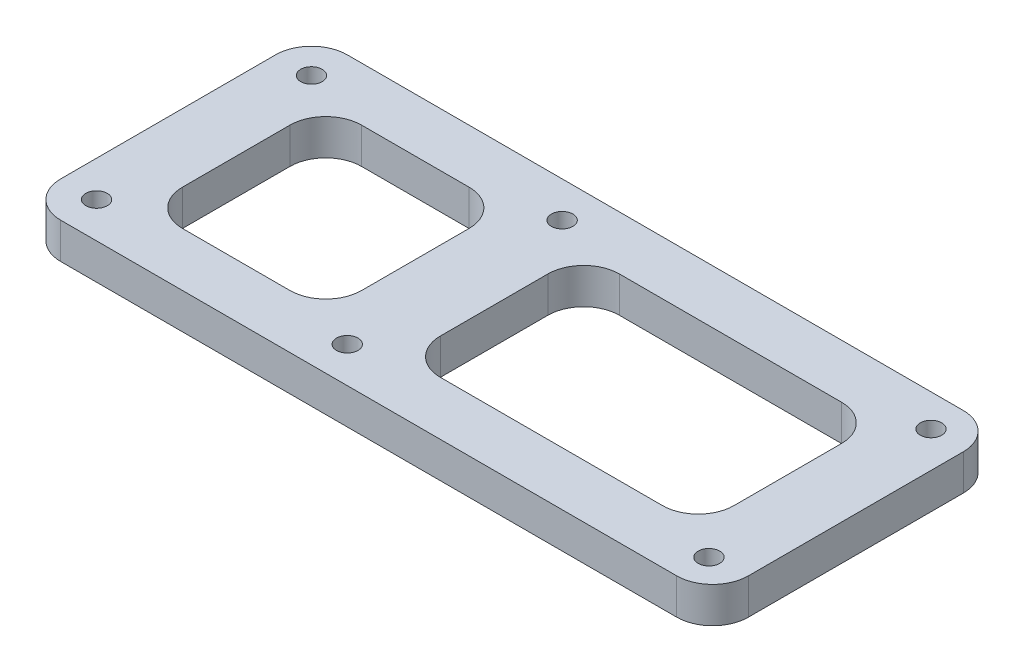
ISO-10303-21;
HEADER;
FILE_DESCRIPTION(('STEP AP214'),'2;1');
FILE_NAME('part.step','',(''),(''),'','','');
FILE_SCHEMA(('AUTOMOTIVE_DESIGN { 1 0 10303 214 1 1 1 1 }'));
ENDSEC;
DATA;
#1=APPLICATION_CONTEXT('core data for automotive mechanical design processes');
#2=APPLICATION_PROTOCOL_DEFINITION('international standard','automotive_design',2000,#1);
#3=PRODUCT_CONTEXT('',#1,'mechanical');
#4=PRODUCT('Part','Part','',(#3));
#5=PRODUCT_RELATED_PRODUCT_CATEGORY('part','',(#4));
#6=PRODUCT_DEFINITION_FORMATION('','',#4);
#7=PRODUCT_DEFINITION_CONTEXT('part definition',#1,'design');
#8=PRODUCT_DEFINITION('design','',#6,#7);
#9=PRODUCT_DEFINITION_SHAPE('','',#8);
#10=(LENGTH_UNIT() NAMED_UNIT(*) SI_UNIT(.MILLI.,.METRE.));
#11=(NAMED_UNIT(*) PLANE_ANGLE_UNIT() SI_UNIT($,.RADIAN.));
#12=(NAMED_UNIT(*) SI_UNIT($,.STERADIAN.) SOLID_ANGLE_UNIT());
#13=UNCERTAINTY_MEASURE_WITH_UNIT(LENGTH_MEASURE(1.E-05),#10,'distance_accuracy_value','');
#14=(GEOMETRIC_REPRESENTATION_CONTEXT(3) GLOBAL_UNCERTAINTY_ASSIGNED_CONTEXT((#13)) GLOBAL_UNIT_ASSIGNED_CONTEXT((#10,
#11,#12)) REPRESENTATION_CONTEXT('',''));
#15=CARTESIAN_POINT('',(0.,0.,0.));
#16=DIRECTION('',(0.,0.,1.));
#17=DIRECTION('',(1.,0.,0.));
#18=AXIS2_PLACEMENT_3D('',#15,#16,#17);
#19=CARTESIAN_POINT('',(0.,5.,12.5));
#20=DIRECTION('',(0.,0.,-1.));
#21=DIRECTION('',(-1.,0.,0.));
#22=AXIS2_PLACEMENT_3D('',#19,#20,#21);
#23=PLANE('',#22);
#24=DIRECTION('',(1.,0.,0.));
#25=VECTOR('',#24,1.);
#26=CARTESIAN_POINT('',(0.,5.,12.5));
#27=LINE('',#26,#25);
#28=CARTESIAN_POINT('',(-25.5,5.,12.5));
#29=VERTEX_POINT('',#28);
#30=CARTESIAN_POINT('',(-10.5,5.,12.5));
#31=VERTEX_POINT('',#30);
#32=EDGE_CURVE('E368',#29,#31,#27,.T.);
#33=ORIENTED_EDGE('',*,*,#32,.T.);
#34=DIRECTION('',(0.,-1.,0.));
#35=VECTOR('',#34,1.);
#36=CARTESIAN_POINT('',(-10.5,5.,12.5));
#37=LINE('',#36,#35);
#38=CARTESIAN_POINT('',(-10.5,0.,12.5));
#39=VERTEX_POINT('',#38);
#40=EDGE_CURVE('E248',#31,#39,#37,.T.);
#41=ORIENTED_EDGE('',*,*,#40,.T.);
#42=DIRECTION('',(1.,0.,0.));
#43=VECTOR('',#42,1.);
#44=CARTESIAN_POINT('',(0.,0.,12.5));
#45=LINE('',#44,#43);
#46=CARTESIAN_POINT('',(-25.5,0.,12.5));
#47=VERTEX_POINT('',#46);
#48=EDGE_CURVE('E409',#47,#39,#45,.T.);
#49=ORIENTED_EDGE('',*,*,#48,.F.);
#50=DIRECTION('',(0.,-1.,0.));
#51=VECTOR('',#50,1.);
#52=CARTESIAN_POINT('',(-25.5,5.,12.5));
#53=LINE('',#52,#51);
#54=EDGE_CURVE('E246',#47,#29,#53,.F.);
#55=ORIENTED_EDGE('',*,*,#54,.T.);
#56=EDGE_LOOP('',(#33,#41,#49,#55));
#57=FACE_BOUND('',#56,.T.);
#58=ADVANCED_FACE('F35',(#57),#23,.T.);
#59=CARTESIAN_POINT('',(-30.5,5.,0.));
#60=DIRECTION('',(1.,0.,0.));
#61=DIRECTION('',(0.,0.,-1.));
#62=AXIS2_PLACEMENT_3D('',#59,#60,#61);
#63=PLANE('',#62);
#64=DIRECTION('',(0.,0.,1.));
#65=VECTOR('',#64,1.);
#66=CARTESIAN_POINT('',(-30.5,5.,0.));
#67=LINE('',#66,#65);
#68=CARTESIAN_POINT('',(-30.5,5.,-7.5));
#69=VERTEX_POINT('',#68);
#70=CARTESIAN_POINT('',(-30.5,5.,7.5));
#71=VERTEX_POINT('',#70);
#72=EDGE_CURVE('E371',#69,#71,#67,.T.);
#73=ORIENTED_EDGE('',*,*,#72,.T.);
#74=DIRECTION('',(0.,-1.,0.));
#75=VECTOR('',#74,1.);
#76=CARTESIAN_POINT('',(-30.5,0.,7.5));
#77=LINE('',#76,#75);
#78=CARTESIAN_POINT('',(-30.5,0.,7.5));
#79=VERTEX_POINT('',#78);
#80=EDGE_CURVE('E258',#71,#79,#77,.T.);
#81=ORIENTED_EDGE('',*,*,#80,.T.);
#82=DIRECTION('',(0.,0.,1.));
#83=VECTOR('',#82,1.);
#84=CARTESIAN_POINT('',(-30.5,0.,0.));
#85=LINE('',#84,#83);
#86=CARTESIAN_POINT('',(-30.5,0.,-7.5));
#87=VERTEX_POINT('',#86);
#88=EDGE_CURVE('E412',#87,#79,#85,.T.);
#89=ORIENTED_EDGE('',*,*,#88,.F.);
#90=DIRECTION('',(0.,-1.,0.));
#91=VECTOR('',#90,1.);
#92=CARTESIAN_POINT('',(-30.5,5.,-7.5));
#93=LINE('',#92,#91);
#94=EDGE_CURVE('E256',#87,#69,#93,.F.);
#95=ORIENTED_EDGE('',*,*,#94,.T.);
#96=EDGE_LOOP('',(#73,#81,#89,#95));
#97=FACE_BOUND('',#96,.T.);
#98=ADVANCED_FACE('F459',(#97),#63,.T.);
#99=CARTESIAN_POINT('',(0.,5.,-12.5));
#100=DIRECTION('',(0.,0.,-1.));
#101=DIRECTION('',(-1.,0.,0.));
#102=AXIS2_PLACEMENT_3D('',#99,#100,#101);
#103=PLANE('',#102);
#104=DIRECTION('',(1.,0.,0.));
#105=VECTOR('',#104,1.);
#106=CARTESIAN_POINT('',(0.,0.,-12.5));
#107=LINE('',#106,#105);
#108=CARTESIAN_POINT('',(-25.5,0.,-12.5));
#109=VERTEX_POINT('',#108);
#110=CARTESIAN_POINT('',(-10.5,0.,-12.5));
#111=VERTEX_POINT('',#110);
#112=EDGE_CURVE('E415',#109,#111,#107,.T.);
#113=ORIENTED_EDGE('',*,*,#112,.T.);
#114=DIRECTION('',(0.,-1.,0.));
#115=VECTOR('',#114,1.);
#116=CARTESIAN_POINT('',(-10.5,5.,-12.5));
#117=LINE('',#116,#115);
#118=CARTESIAN_POINT('',(-10.5,5.,-12.5));
#119=VERTEX_POINT('',#118);
#120=EDGE_CURVE('E264',#111,#119,#117,.F.);
#121=ORIENTED_EDGE('',*,*,#120,.T.);
#122=DIRECTION('',(1.,0.,0.));
#123=VECTOR('',#122,1.);
#124=CARTESIAN_POINT('',(0.,5.,-12.5));
#125=LINE('',#124,#123);
#126=CARTESIAN_POINT('',(-25.5,5.,-12.5));
#127=VERTEX_POINT('',#126);
#128=EDGE_CURVE('E374',#127,#119,#125,.T.);
#129=ORIENTED_EDGE('',*,*,#128,.F.);
#130=DIRECTION('',(0.,-1.,0.));
#131=VECTOR('',#130,1.);
#132=CARTESIAN_POINT('',(-25.5,5.,-12.5));
#133=LINE('',#132,#131);
#134=EDGE_CURVE('E261',#127,#109,#133,.T.);
#135=ORIENTED_EDGE('',*,*,#134,.T.);
#136=EDGE_LOOP('',(#113,#121,#129,#135));
#137=FACE_BOUND('',#136,.T.);
#138=ADVANCED_FACE('F465',(#137),#103,.F.);
#139=CARTESIAN_POINT('',(0.,5.,20.));
#140=DIRECTION('',(0.,0.,-1.));
#141=DIRECTION('',(-1.,0.,0.));
#142=AXIS2_PLACEMENT_3D('',#139,#140,#141);
#143=PLANE('',#142);
#144=DIRECTION('',(1.,0.,0.));
#145=VECTOR('',#144,1.);
#146=CARTESIAN_POINT('',(0.,0.,20.));
#147=LINE('',#146,#145);
#148=CARTESIAN_POINT('',(-35.,0.,20.));
#149=VERTEX_POINT('',#148);
#150=CARTESIAN_POINT('',(51.,0.,20.));
#151=VERTEX_POINT('',#150);
#152=EDGE_CURVE('E395',#149,#151,#147,.T.);
#153=ORIENTED_EDGE('',*,*,#152,.T.);
#154=DIRECTION('',(0.,-1.,0.));
#155=VECTOR('',#154,1.);
#156=CARTESIAN_POINT('',(51.,5.,20.));
#157=LINE('',#156,#155);
#158=CARTESIAN_POINT('',(51.,5.,20.));
#159=VERTEX_POINT('',#158);
#160=EDGE_CURVE('E294',#151,#159,#157,.F.);
#161=ORIENTED_EDGE('',*,*,#160,.T.);
#162=DIRECTION('',(1.,0.,0.));
#163=VECTOR('',#162,1.);
#164=CARTESIAN_POINT('',(0.,5.,20.));
#165=LINE('',#164,#163);
#166=CARTESIAN_POINT('',(-35.,5.,20.));
#167=VERTEX_POINT('',#166);
#168=EDGE_CURVE('E349',#167,#159,#165,.T.);
#169=ORIENTED_EDGE('',*,*,#168,.F.);
#170=DIRECTION('',(0.,-1.,0.));
#171=VECTOR('',#170,1.);
#172=CARTESIAN_POINT('',(-35.,5.,20.));
#173=LINE('',#172,#171);
#174=EDGE_CURVE('E291',#167,#149,#173,.T.);
#175=ORIENTED_EDGE('',*,*,#174,.T.);
#176=EDGE_LOOP('',(#153,#161,#169,#175));
#177=FACE_BOUND('',#176,.T.);
#178=ADVANCED_FACE('F485',(#177),#143,.F.);
#179=CARTESIAN_POINT('',(56.,5.,0.));
#180=DIRECTION('',(1.,0.,0.));
#181=DIRECTION('',(0.,0.,-1.));
#182=AXIS2_PLACEMENT_3D('',#179,#180,#181);
#183=PLANE('',#182);
#184=DIRECTION('',(0.,0.,1.));
#185=VECTOR('',#184,1.);
#186=CARTESIAN_POINT('',(56.,0.,0.));
#187=LINE('',#186,#185);
#188=CARTESIAN_POINT('',(56.,0.,-15.));
#189=VERTEX_POINT('',#188);
#190=CARTESIAN_POINT('',(56.,0.,15.));
#191=VERTEX_POINT('',#190);
#192=EDGE_CURVE('E398',#189,#191,#187,.T.);
#193=ORIENTED_EDGE('',*,*,#192,.F.);
#194=DIRECTION('',(0.,-1.,0.));
#195=VECTOR('',#194,1.);
#196=CARTESIAN_POINT('',(56.,5.,-15.));
#197=LINE('',#196,#195);
#198=CARTESIAN_POINT('',(56.,5.,-15.));
#199=VERTEX_POINT('',#198);
#200=EDGE_CURVE('E282',#189,#199,#197,.F.);
#201=ORIENTED_EDGE('',*,*,#200,.T.);
#202=DIRECTION('',(0.,0.,1.));
#203=VECTOR('',#202,1.);
#204=CARTESIAN_POINT('',(56.,5.,0.));
#205=LINE('',#204,#203);
#206=CARTESIAN_POINT('',(56.,5.,15.));
#207=VERTEX_POINT('',#206);
#208=EDGE_CURVE('E357',#199,#207,#205,.T.);
#209=ORIENTED_EDGE('',*,*,#208,.T.);
#210=DIRECTION('',(0.,-1.,0.));
#211=VECTOR('',#210,1.);
#212=CARTESIAN_POINT('',(56.,0.,15.));
#213=LINE('',#212,#211);
#214=EDGE_CURVE('E279',#207,#191,#213,.T.);
#215=ORIENTED_EDGE('',*,*,#214,.T.);
#216=EDGE_LOOP('',(#193,#201,#209,#215));
#217=FACE_BOUND('',#216,.T.);
#218=ADVANCED_FACE('F481',(#217),#183,.T.);
#219=CARTESIAN_POINT('',(0.,5.,-20.));
#220=DIRECTION('',(0.,0.,-1.));
#221=DIRECTION('',(-1.,0.,0.));
#222=AXIS2_PLACEMENT_3D('',#219,#220,#221);
#223=PLANE('',#222);
#224=DIRECTION('',(1.,0.,0.));
#225=VECTOR('',#224,1.);
#226=CARTESIAN_POINT('',(0.,5.,-20.));
#227=LINE('',#226,#225);
#228=CARTESIAN_POINT('',(-35.,5.,-20.));
#229=VERTEX_POINT('',#228);
#230=CARTESIAN_POINT('',(51.,5.,-20.));
#231=VERTEX_POINT('',#230);
#232=EDGE_CURVE('E360',#229,#231,#227,.T.);
#233=ORIENTED_EDGE('',*,*,#232,.T.);
#234=DIRECTION('',(0.,-1.,0.));
#235=VECTOR('',#234,1.);
#236=CARTESIAN_POINT('',(51.,5.,-20.));
#237=LINE('',#236,#235);
#238=CARTESIAN_POINT('',(51.,0.,-20.));
#239=VERTEX_POINT('',#238);
#240=EDGE_CURVE('E268',#231,#239,#237,.T.);
#241=ORIENTED_EDGE('',*,*,#240,.T.);
#242=DIRECTION('',(1.,0.,0.));
#243=VECTOR('',#242,1.);
#244=CARTESIAN_POINT('',(0.,0.,-20.));
#245=LINE('',#244,#243);
#246=CARTESIAN_POINT('',(-35.,0.,-20.));
#247=VERTEX_POINT('',#246);
#248=EDGE_CURVE('E401',#247,#239,#245,.T.);
#249=ORIENTED_EDGE('',*,*,#248,.F.);
#250=DIRECTION('',(0.,-1.,0.));
#251=VECTOR('',#250,1.);
#252=CARTESIAN_POINT('',(-35.,5.,-20.));
#253=LINE('',#252,#251);
#254=EDGE_CURVE('E266',#247,#229,#253,.F.);
#255=ORIENTED_EDGE('',*,*,#254,.T.);
#256=EDGE_LOOP('',(#233,#241,#249,#255));
#257=FACE_BOUND('',#256,.T.);
#258=ADVANCED_FACE('F478',(#257),#223,.T.);
#259=CARTESIAN_POINT('',(0.,5.,12.5));
#260=DIRECTION('',(0.,0.,-1.));
#261=DIRECTION('',(-1.,0.,0.));
#262=AXIS2_PLACEMENT_3D('',#259,#260,#261);
#263=PLANE('',#262);
#264=DIRECTION('',(1.,0.,0.));
#265=VECTOR('',#264,1.);
#266=CARTESIAN_POINT('',(0.,5.,12.5));
#267=LINE('',#266,#265);
#268=CARTESIAN_POINT('',(10.5,5.,12.5));
#269=VERTEX_POINT('',#268);
#270=CARTESIAN_POINT('',(41.5,5.,12.5));
#271=VERTEX_POINT('',#270);
#272=EDGE_CURVE('E351',#269,#271,#267,.T.);
#273=ORIENTED_EDGE('',*,*,#272,.T.);
#274=DIRECTION('',(0.,-1.,0.));
#275=VECTOR('',#274,1.);
#276=CARTESIAN_POINT('',(41.5,5.,12.5));
#277=LINE('',#276,#275);
#278=CARTESIAN_POINT('',(41.5,0.,12.5));
#279=VERTEX_POINT('',#278);
#280=EDGE_CURVE('E218',#271,#279,#277,.T.);
#281=ORIENTED_EDGE('',*,*,#280,.T.);
#282=DIRECTION('',(1.,0.,0.));
#283=VECTOR('',#282,1.);
#284=CARTESIAN_POINT('',(0.,0.,12.5));
#285=LINE('',#284,#283);
#286=CARTESIAN_POINT('',(10.5,0.,12.5));
#287=VERTEX_POINT('',#286);
#288=EDGE_CURVE('E201',#287,#279,#285,.T.);
#289=ORIENTED_EDGE('',*,*,#288,.F.);
#290=DIRECTION('',(0.,-1.,0.));
#291=VECTOR('',#290,1.);
#292=CARTESIAN_POINT('',(10.5,5.,12.5));
#293=LINE('',#292,#291);
#294=EDGE_CURVE('E215',#287,#269,#293,.F.);
#295=ORIENTED_EDGE('',*,*,#294,.T.);
#296=EDGE_LOOP('',(#273,#281,#289,#295));
#297=FACE_BOUND('',#296,.T.);
#298=ADVANCED_FACE('F214',(#297),#263,.T.);
#299=CARTESIAN_POINT('',(5.5,5.,0.));
#300=DIRECTION('',(1.,0.,0.));
#301=DIRECTION('',(0.,0.,-1.));
#302=AXIS2_PLACEMENT_3D('',#299,#300,#301);
#303=PLANE('',#302);
#304=DIRECTION('',(0.,0.,1.));
#305=VECTOR('',#304,1.);
#306=CARTESIAN_POINT('',(5.5,5.,0.));
#307=LINE('',#306,#305);
#308=CARTESIAN_POINT('',(5.5,5.,-7.5));
#309=VERTEX_POINT('',#308);
#310=CARTESIAN_POINT('',(5.5,5.,7.5));
#311=VERTEX_POINT('',#310);
#312=EDGE_CURVE('E342',#309,#311,#307,.T.);
#313=ORIENTED_EDGE('',*,*,#312,.T.);
#314=DIRECTION('',(0.,-1.,0.));
#315=VECTOR('',#314,1.);
#316=CARTESIAN_POINT('',(5.5,0.,7.5));
#317=LINE('',#316,#315);
#318=CARTESIAN_POINT('',(5.5,0.,7.5));
#319=VERTEX_POINT('',#318);
#320=EDGE_CURVE('E239',#311,#319,#317,.T.);
#321=ORIENTED_EDGE('',*,*,#320,.T.);
#322=DIRECTION('',(0.,0.,1.));
#323=VECTOR('',#322,1.);
#324=CARTESIAN_POINT('',(5.5,0.,0.));
#325=LINE('',#324,#323);
#326=CARTESIAN_POINT('',(5.5,0.,-7.5));
#327=VERTEX_POINT('',#326);
#328=EDGE_CURVE('E203',#327,#319,#325,.T.);
#329=ORIENTED_EDGE('',*,*,#328,.F.);
#330=DIRECTION('',(0.,-1.,0.));
#331=VECTOR('',#330,1.);
#332=CARTESIAN_POINT('',(5.5,5.,-7.5));
#333=LINE('',#332,#331);
#334=EDGE_CURVE('E237',#327,#309,#333,.F.);
#335=ORIENTED_EDGE('',*,*,#334,.T.);
#336=EDGE_LOOP('',(#313,#321,#329,#335));
#337=FACE_BOUND('',#336,.T.);
#338=ADVANCED_FACE('F331',(#337),#303,.T.);
#339=CARTESIAN_POINT('',(0.,5.,-12.5));
#340=DIRECTION('',(0.,0.,-1.));
#341=DIRECTION('',(-1.,0.,0.));
#342=AXIS2_PLACEMENT_3D('',#339,#340,#341);
#343=PLANE('',#342);
#344=DIRECTION('',(1.,0.,0.));
#345=VECTOR('',#344,1.);
#346=CARTESIAN_POINT('',(0.,0.,-12.5));
#347=LINE('',#346,#345);
#348=CARTESIAN_POINT('',(10.5,0.,-12.5));
#349=VERTEX_POINT('',#348);
#350=CARTESIAN_POINT('',(41.5,0.,-12.5));
#351=VERTEX_POINT('',#350);
#352=EDGE_CURVE('E325',#349,#351,#347,.T.);
#353=ORIENTED_EDGE('',*,*,#352,.T.);
#354=DIRECTION('',(0.,-1.,0.));
#355=VECTOR('',#354,1.);
#356=CARTESIAN_POINT('',(41.5,5.,-12.5));
#357=LINE('',#356,#355);
#358=CARTESIAN_POINT('',(41.5,5.,-12.5));
#359=VERTEX_POINT('',#358);
#360=EDGE_CURVE('E244',#351,#359,#357,.F.);
#361=ORIENTED_EDGE('',*,*,#360,.T.);
#362=DIRECTION('',(1.,0.,0.));
#363=VECTOR('',#362,1.);
#364=CARTESIAN_POINT('',(0.,5.,-12.5));
#365=LINE('',#364,#363);
#366=CARTESIAN_POINT('',(10.5,5.,-12.5));
#367=VERTEX_POINT('',#366);
#368=EDGE_CURVE('E340',#367,#359,#365,.T.);
#369=ORIENTED_EDGE('',*,*,#368,.F.);
#370=DIRECTION('',(0.,-1.,0.));
#371=VECTOR('',#370,1.);
#372=CARTESIAN_POINT('',(10.5,5.,-12.5));
#373=LINE('',#372,#371);
#374=EDGE_CURVE('E241',#367,#349,#373,.T.);
#375=ORIENTED_EDGE('',*,*,#374,.T.);
#376=EDGE_LOOP('',(#353,#361,#369,#375));
#377=FACE_BOUND('',#376,.T.);
#378=ADVANCED_FACE('F344',(#377),#343,.F.);
#379=CARTESIAN_POINT('',(-35.,5.,15.));
#380=DIRECTION('',(0.,-1.,0.));
#381=DIRECTION('',(0.,0.,-1.));
#382=AXIS2_PLACEMENT_3D('',#379,#380,#381);
#383=CYLINDRICAL_SURFACE('',#382,1.5);
#384=CARTESIAN_POINT('',(-35.,5.,15.));
#385=DIRECTION('',(0.,1.,0.));
#386=DIRECTION('',(0.,0.,1.));
#387=AXIS2_PLACEMENT_3D('',#384,#385,#386);
#388=CIRCLE('',#387,1.5);
#389=CARTESIAN_POINT('',(-35.,5.,16.5));
#390=VERTEX_POINT('',#389);
#391=EDGE_CURVE('E227',#390,#390,#388,.T.);
#392=ORIENTED_EDGE('',*,*,#391,.T.);
#393=EDGE_LOOP('',(#392));
#394=FACE_BOUND('',#393,.T.);
#395=CARTESIAN_POINT('',(-35.,0.,15.));
#396=DIRECTION('',(0.,1.,0.));
#397=DIRECTION('',(0.,0.,1.));
#398=AXIS2_PLACEMENT_3D('',#395,#396,#397);
#399=CIRCLE('',#398,1.5);
#400=CARTESIAN_POINT('',(-35.,0.,16.5));
#401=VERTEX_POINT('',#400);
#402=EDGE_CURVE('E429',#401,#401,#399,.T.);
#403=ORIENTED_EDGE('',*,*,#402,.F.);
#404=EDGE_LOOP('',(#403));
#405=FACE_BOUND('',#404,.T.);
#406=ADVANCED_FACE('F495',(#394,#405),#383,.F.);
#407=CARTESIAN_POINT('',(0.,5.,15.));
#408=DIRECTION('',(0.,-1.,0.));
#409=DIRECTION('',(0.,0.,-1.));
#410=AXIS2_PLACEMENT_3D('',#407,#408,#409);
#411=CYLINDRICAL_SURFACE('',#410,1.5);
#412=CARTESIAN_POINT('',(0.,5.,15.));
#413=DIRECTION('',(0.,1.,0.));
#414=DIRECTION('',(0.,0.,1.));
#415=AXIS2_PLACEMENT_3D('',#412,#413,#414);
#416=CIRCLE('',#415,1.5);
#417=CARTESIAN_POINT('',(0.,5.,16.5));
#418=VERTEX_POINT('',#417);
#419=EDGE_CURVE('E386',#418,#418,#416,.T.);
#420=ORIENTED_EDGE('',*,*,#419,.T.);
#421=EDGE_LOOP('',(#420));
#422=FACE_BOUND('',#421,.T.);
#423=CARTESIAN_POINT('',(0.,0.,15.));
#424=DIRECTION('',(0.,1.,0.));
#425=DIRECTION('',(0.,0.,1.));
#426=AXIS2_PLACEMENT_3D('',#423,#424,#425);
#427=CIRCLE('',#426,1.5);
#428=CARTESIAN_POINT('',(0.,0.,16.5));
#429=VERTEX_POINT('',#428);
#430=EDGE_CURVE('E427',#429,#429,#427,.T.);
#431=ORIENTED_EDGE('',*,*,#430,.F.);
#432=EDGE_LOOP('',(#431));
#433=FACE_BOUND('',#432,.T.);
#434=ADVANCED_FACE('F515',(#422,#433),#411,.F.);
#435=CARTESIAN_POINT('',(50.9975489607099,5.,-15.5));
#436=DIRECTION('',(0.,-1.,0.));
#437=DIRECTION('',(0.,0.,-1.));
#438=AXIS2_PLACEMENT_3D('',#435,#436,#437);
#439=CYLINDRICAL_SURFACE('',#438,1.5);
#440=CARTESIAN_POINT('',(50.9975489607099,5.,-15.5));
#441=DIRECTION('',(0.,1.,0.));
#442=DIRECTION('',(0.,0.,1.));
#443=AXIS2_PLACEMENT_3D('',#440,#441,#442);
#444=CIRCLE('',#443,1.5);
#445=CARTESIAN_POINT('',(50.9975489607099,5.,-14.));
#446=VERTEX_POINT('',#445);
#447=EDGE_CURVE('E383',#446,#446,#444,.F.);
#448=ORIENTED_EDGE('',*,*,#447,.F.);
#449=EDGE_LOOP('',(#448));
#450=FACE_BOUND('',#449,.T.);
#451=CARTESIAN_POINT('',(50.9975489607099,0.,-15.5));
#452=DIRECTION('',(0.,1.,0.));
#453=DIRECTION('',(0.,0.,1.));
#454=AXIS2_PLACEMENT_3D('',#451,#452,#453);
#455=CIRCLE('',#454,1.5);
#456=CARTESIAN_POINT('',(50.9975489607099,0.,-14.));
#457=VERTEX_POINT('',#456);
#458=EDGE_CURVE('E424',#457,#457,#455,.F.);
#459=ORIENTED_EDGE('',*,*,#458,.T.);
#460=EDGE_LOOP('',(#459));
#461=FACE_BOUND('',#460,.T.);
#462=ADVANCED_FACE('F519',(#450,#461),#439,.F.);
#463=CARTESIAN_POINT('',(-35.,5.,-15.));
#464=DIRECTION('',(0.,-1.,0.));
#465=DIRECTION('',(0.,0.,-1.));
#466=AXIS2_PLACEMENT_3D('',#463,#464,#465);
#467=CYLINDRICAL_SURFACE('',#466,1.5);
#468=CARTESIAN_POINT('',(-35.,5.,-15.));
#469=DIRECTION('',(0.,1.,0.));
#470=DIRECTION('',(0.,0.,1.));
#471=AXIS2_PLACEMENT_3D('',#468,#469,#470);
#472=CIRCLE('',#471,1.5);
#473=CARTESIAN_POINT('',(-35.,5.,-13.5));
#474=VERTEX_POINT('',#473);
#475=EDGE_CURVE('E380',#474,#474,#472,.T.);
#476=ORIENTED_EDGE('',*,*,#475,.T.);
#477=EDGE_LOOP('',(#476));
#478=FACE_BOUND('',#477,.T.);
#479=CARTESIAN_POINT('',(-35.,0.,-15.));
#480=DIRECTION('',(0.,1.,0.));
#481=DIRECTION('',(0.,0.,1.));
#482=AXIS2_PLACEMENT_3D('',#479,#480,#481);
#483=CIRCLE('',#482,1.5);
#484=CARTESIAN_POINT('',(-35.,0.,-13.5));
#485=VERTEX_POINT('',#484);
#486=EDGE_CURVE('E421',#485,#485,#483,.T.);
#487=ORIENTED_EDGE('',*,*,#486,.F.);
#488=EDGE_LOOP('',(#487));
#489=FACE_BOUND('',#488,.T.);
#490=ADVANCED_FACE('F523',(#478,#489),#467,.F.);
#491=CARTESIAN_POINT('',(-5.5,5.,0.));
#492=DIRECTION('',(1.,0.,0.));
#493=DIRECTION('',(0.,0.,-1.));
#494=AXIS2_PLACEMENT_3D('',#491,#492,#493);
#495=PLANE('',#494);
#496=DIRECTION('',(0.,0.,1.));
#497=VECTOR('',#496,1.);
#498=CARTESIAN_POINT('',(-5.5,0.,0.));
#499=LINE('',#498,#497);
#500=CARTESIAN_POINT('',(-5.5,0.,-7.5));
#501=VERTEX_POINT('',#500);
#502=CARTESIAN_POINT('',(-5.5,0.,7.5));
#503=VERTEX_POINT('',#502);
#504=EDGE_CURVE('E418',#501,#503,#499,.T.);
#505=ORIENTED_EDGE('',*,*,#504,.T.);
#506=DIRECTION('',(0.,-1.,0.));
#507=VECTOR('',#506,1.);
#508=CARTESIAN_POINT('',(-5.5,5.,7.5));
#509=LINE('',#508,#507);
#510=CARTESIAN_POINT('',(-5.5,5.,7.5));
#511=VERTEX_POINT('',#510);
#512=EDGE_CURVE('E254',#503,#511,#509,.F.);
#513=ORIENTED_EDGE('',*,*,#512,.T.);
#514=DIRECTION('',(0.,0.,1.));
#515=VECTOR('',#514,1.);
#516=CARTESIAN_POINT('',(-5.5,5.,0.));
#517=LINE('',#516,#515);
#518=CARTESIAN_POINT('',(-5.5,5.,-7.5));
#519=VERTEX_POINT('',#518);
#520=EDGE_CURVE('E377',#519,#511,#517,.T.);
#521=ORIENTED_EDGE('',*,*,#520,.F.);
#522=DIRECTION('',(0.,-1.,0.));
#523=VECTOR('',#522,1.);
#524=CARTESIAN_POINT('',(-5.5,0.,-7.5));
#525=LINE('',#524,#523);
#526=EDGE_CURVE('E251',#519,#501,#525,.T.);
#527=ORIENTED_EDGE('',*,*,#526,.T.);
#528=EDGE_LOOP('',(#505,#513,#521,#527));
#529=FACE_BOUND('',#528,.T.);
#530=ADVANCED_FACE('F474',(#529),#495,.F.);
#531=CARTESIAN_POINT('',(0.,5.,-15.));
#532=DIRECTION('',(0.,-1.,0.));
#533=DIRECTION('',(0.,0.,-1.));
#534=AXIS2_PLACEMENT_3D('',#531,#532,#533);
#535=CYLINDRICAL_SURFACE('',#534,1.5);
#536=CARTESIAN_POINT('',(0.,5.,-15.));
#537=DIRECTION('',(0.,1.,0.));
#538=DIRECTION('',(0.,0.,1.));
#539=AXIS2_PLACEMENT_3D('',#536,#537,#538);
#540=CIRCLE('',#539,1.5);
#541=CARTESIAN_POINT('',(0.,5.,-13.5));
#542=VERTEX_POINT('',#541);
#543=EDGE_CURVE('E365',#542,#542,#540,.T.);
#544=ORIENTED_EDGE('',*,*,#543,.T.);
#545=EDGE_LOOP('',(#544));
#546=FACE_BOUND('',#545,.T.);
#547=CARTESIAN_POINT('',(0.,0.,-15.));
#548=DIRECTION('',(0.,1.,0.));
#549=DIRECTION('',(0.,0.,1.));
#550=AXIS2_PLACEMENT_3D('',#547,#548,#549);
#551=CIRCLE('',#550,1.5);
#552=CARTESIAN_POINT('',(0.,0.,-13.5));
#553=VERTEX_POINT('',#552);
#554=EDGE_CURVE('E406',#553,#553,#551,.T.);
#555=ORIENTED_EDGE('',*,*,#554,.F.);
#556=EDGE_LOOP('',(#555));
#557=FACE_BOUND('',#556,.T.);
#558=ADVANCED_FACE('F470',(#546,#557),#535,.F.);
#559=CARTESIAN_POINT('',(-40.,5.,0.));
#560=DIRECTION('',(1.,0.,0.));
#561=DIRECTION('',(0.,0.,-1.));
#562=AXIS2_PLACEMENT_3D('',#559,#560,#561);
#563=PLANE('',#562);
#564=DIRECTION('',(0.,0.,1.));
#565=VECTOR('',#564,1.);
#566=CARTESIAN_POINT('',(-40.,0.,0.));
#567=LINE('',#566,#565);
#568=CARTESIAN_POINT('',(-40.,0.,-15.));
#569=VERTEX_POINT('',#568);
#570=CARTESIAN_POINT('',(-40.,0.,15.));
#571=VERTEX_POINT('',#570);
#572=EDGE_CURVE('E404',#569,#571,#567,.T.);
#573=ORIENTED_EDGE('',*,*,#572,.T.);
#574=DIRECTION('',(0.,-1.,0.));
#575=VECTOR('',#574,1.);
#576=CARTESIAN_POINT('',(-40.,5.,15.));
#577=LINE('',#576,#575);
#578=CARTESIAN_POINT('',(-40.,5.,15.));
#579=VERTEX_POINT('',#578);
#580=EDGE_CURVE('E50',#571,#579,#577,.F.);
#581=ORIENTED_EDGE('',*,*,#580,.T.);
#582=DIRECTION('',(0.,0.,1.));
#583=VECTOR('',#582,1.);
#584=CARTESIAN_POINT('',(-40.,5.,0.));
#585=LINE('',#584,#583);
#586=CARTESIAN_POINT('',(-40.,5.,-15.));
#587=VERTEX_POINT('',#586);
#588=EDGE_CURVE('E363',#587,#579,#585,.T.);
#589=ORIENTED_EDGE('',*,*,#588,.F.);
#590=DIRECTION('',(0.,-1.,0.));
#591=VECTOR('',#590,1.);
#592=CARTESIAN_POINT('',(-40.,0.,-15.));
#593=LINE('',#592,#591);
#594=EDGE_CURVE('E296',#587,#569,#593,.T.);
#595=ORIENTED_EDGE('',*,*,#594,.T.);
#596=EDGE_LOOP('',(#573,#581,#589,#595));
#597=FACE_BOUND('',#596,.T.);
#598=ADVANCED_FACE('F473',(#597),#563,.F.);
#599=CARTESIAN_POINT('',(46.5,5.,0.));
#600=DIRECTION('',(1.,0.,0.));
#601=DIRECTION('',(0.,0.,-1.));
#602=AXIS2_PLACEMENT_3D('',#599,#600,#601);
#603=PLANE('',#602);
#604=DIRECTION('',(0.,0.,1.));
#605=VECTOR('',#604,1.);
#606=CARTESIAN_POINT('',(46.5,0.,0.));
#607=LINE('',#606,#605);
#608=CARTESIAN_POINT('',(46.5,0.,-7.5));
#609=VERTEX_POINT('',#608);
#610=CARTESIAN_POINT('',(46.5,0.,7.5));
#611=VERTEX_POINT('',#610);
#612=EDGE_CURVE('E392',#609,#611,#607,.T.);
#613=ORIENTED_EDGE('',*,*,#612,.T.);
#614=DIRECTION('',(0.,-1.,0.));
#615=VECTOR('',#614,1.);
#616=CARTESIAN_POINT('',(46.5,5.,7.5));
#617=LINE('',#616,#615);
#618=CARTESIAN_POINT('',(46.5,5.,7.5));
#619=VERTEX_POINT('',#618);
#620=EDGE_CURVE('E235',#611,#619,#617,.F.);
#621=ORIENTED_EDGE('',*,*,#620,.T.);
#622=DIRECTION('',(0.,0.,1.));
#623=VECTOR('',#622,1.);
#624=CARTESIAN_POINT('',(46.5,5.,0.));
#625=LINE('',#624,#623);
#626=CARTESIAN_POINT('',(46.5,5.,-7.5));
#627=VERTEX_POINT('',#626);
#628=EDGE_CURVE('E346',#627,#619,#625,.T.);
#629=ORIENTED_EDGE('',*,*,#628,.F.);
#630=DIRECTION('',(0.,-1.,0.));
#631=VECTOR('',#630,1.);
#632=CARTESIAN_POINT('',(46.5,0.,-7.5));
#633=LINE('',#632,#631);
#634=EDGE_CURVE('E224',#627,#609,#633,.T.);
#635=ORIENTED_EDGE('',*,*,#634,.T.);
#636=EDGE_LOOP('',(#613,#621,#629,#635));
#637=FACE_BOUND('',#636,.T.);
#638=ADVANCED_FACE('F442',(#637),#603,.F.);
#639=CARTESIAN_POINT('',(50.9975489607099,5.,15.5));
#640=DIRECTION('',(0.,-1.,0.));
#641=DIRECTION('',(0.,0.,-1.));
#642=AXIS2_PLACEMENT_3D('',#639,#640,#641);
#643=CYLINDRICAL_SURFACE('',#642,1.5);
#644=CARTESIAN_POINT('',(50.9975489607099,5.,15.5));
#645=DIRECTION('',(0.,1.,0.));
#646=DIRECTION('',(0.,0.,1.));
#647=AXIS2_PLACEMENT_3D('',#644,#645,#646);
#648=CIRCLE('',#647,1.5);
#649=CARTESIAN_POINT('',(50.9975489607099,5.,17.));
#650=VERTEX_POINT('',#649);
#651=EDGE_CURVE('E222',#650,#650,#648,.T.);
#652=ORIENTED_EDGE('',*,*,#651,.T.);
#653=EDGE_LOOP('',(#652));
#654=FACE_BOUND('',#653,.T.);
#655=CARTESIAN_POINT('',(50.9975489607099,0.,15.5));
#656=DIRECTION('',(0.,1.,0.));
#657=DIRECTION('',(0.,0.,1.));
#658=AXIS2_PLACEMENT_3D('',#655,#656,#657);
#659=CIRCLE('',#658,1.5);
#660=CARTESIAN_POINT('',(50.9975489607099,0.,17.));
#661=VERTEX_POINT('',#660);
#662=EDGE_CURVE('E230',#661,#661,#659,.T.);
#663=ORIENTED_EDGE('',*,*,#662,.F.);
#664=EDGE_LOOP('',(#663));
#665=FACE_BOUND('',#664,.T.);
#666=ADVANCED_FACE('F492',(#654,#665),#643,.F.);
#667=CARTESIAN_POINT('',(0.,5.,0.));
#668=DIRECTION('',(0.,1.,0.));
#669=DIRECTION('',(0.,0.,1.));
#670=AXIS2_PLACEMENT_3D('',#667,#668,#669);
#671=PLANE('',#670);
#672=ORIENTED_EDGE('',*,*,#272,.F.);
#673=CARTESIAN_POINT('',(10.5,5.,7.5));
#674=DIRECTION('',(0.,1.,0.));
#675=DIRECTION('',(0.,0.,1.));
#676=AXIS2_PLACEMENT_3D('',#673,#674,#675);
#677=CIRCLE('',#676,5.);
#678=EDGE_CURVE('E208',#269,#311,#677,.F.);
#679=ORIENTED_EDGE('',*,*,#678,.T.);
#680=ORIENTED_EDGE('',*,*,#312,.F.);
#681=CARTESIAN_POINT('',(10.5,5.,-7.5));
#682=DIRECTION('',(0.,1.,0.));
#683=DIRECTION('',(0.,0.,1.));
#684=AXIS2_PLACEMENT_3D('',#681,#682,#683);
#685=CIRCLE('',#684,5.);
#686=EDGE_CURVE('E11',#309,#367,#685,.F.);
#687=ORIENTED_EDGE('',*,*,#686,.T.);
#688=ORIENTED_EDGE('',*,*,#368,.T.);
#689=CARTESIAN_POINT('',(41.5,5.,-7.5));
#690=DIRECTION('',(0.,1.,0.));
#691=DIRECTION('',(0.,0.,1.));
#692=AXIS2_PLACEMENT_3D('',#689,#690,#691);
#693=CIRCLE('',#692,5.);
#694=EDGE_CURVE('E306',#359,#627,#693,.F.);
#695=ORIENTED_EDGE('',*,*,#694,.T.);
#696=ORIENTED_EDGE('',*,*,#628,.T.);
#697=CARTESIAN_POINT('',(41.5,5.,7.5));
#698=DIRECTION('',(0.,1.,0.));
#699=DIRECTION('',(0.,0.,1.));
#700=AXIS2_PLACEMENT_3D('',#697,#698,#699);
#701=CIRCLE('',#700,5.);
#702=EDGE_CURVE('E209',#619,#271,#701,.F.);
#703=ORIENTED_EDGE('',*,*,#702,.T.);
#704=EDGE_LOOP('',(#672,#679,#680,#687,#688,#695,#696,#703));
#705=FACE_BOUND('',#704,.T.);
#706=ORIENTED_EDGE('',*,*,#208,.F.);
#707=CARTESIAN_POINT('',(51.,5.,-15.));
#708=DIRECTION('',(0.,1.,0.));
#709=DIRECTION('',(0.,0.,1.));
#710=AXIS2_PLACEMENT_3D('',#707,#708,#709);
#711=CIRCLE('',#710,5.);
#712=EDGE_CURVE('E289',#199,#231,#711,.T.);
#713=ORIENTED_EDGE('',*,*,#712,.T.);
#714=ORIENTED_EDGE('',*,*,#232,.F.);
#715=CARTESIAN_POINT('',(-35.,5.,-15.));
#716=DIRECTION('',(0.,1.,0.));
#717=DIRECTION('',(0.,0.,1.));
#718=AXIS2_PLACEMENT_3D('',#715,#716,#717);
#719=CIRCLE('',#718,5.);
#720=EDGE_CURVE('E57',#229,#587,#719,.T.);
#721=ORIENTED_EDGE('',*,*,#720,.T.);
#722=ORIENTED_EDGE('',*,*,#588,.T.);
#723=CARTESIAN_POINT('',(-35.,5.,15.));
#724=DIRECTION('',(0.,1.,0.));
#725=DIRECTION('',(0.,0.,1.));
#726=AXIS2_PLACEMENT_3D('',#723,#724,#725);
#727=CIRCLE('',#726,5.);
#728=EDGE_CURVE('E285',#579,#167,#727,.T.);
#729=ORIENTED_EDGE('',*,*,#728,.T.);
#730=ORIENTED_EDGE('',*,*,#168,.T.);
#731=CARTESIAN_POINT('',(51.,5.,15.));
#732=DIRECTION('',(0.,1.,0.));
#733=DIRECTION('',(0.,0.,1.));
#734=AXIS2_PLACEMENT_3D('',#731,#732,#733);
#735=CIRCLE('',#734,5.);
#736=EDGE_CURVE('E287',#159,#207,#735,.T.);
#737=ORIENTED_EDGE('',*,*,#736,.T.);
#738=EDGE_LOOP('',(#706,#713,#714,#721,#722,#729,#730,#737));
#739=FACE_BOUND('',#738,.T.);
#740=ORIENTED_EDGE('',*,*,#543,.F.);
#741=EDGE_LOOP('',(#740));
#742=FACE_BOUND('',#741,.T.);
#743=ORIENTED_EDGE('',*,*,#32,.F.);
#744=CARTESIAN_POINT('',(-25.5,5.,7.5));
#745=DIRECTION('',(0.,1.,0.));
#746=DIRECTION('',(0.,0.,1.));
#747=AXIS2_PLACEMENT_3D('',#744,#745,#746);
#748=CIRCLE('',#747,5.);
#749=EDGE_CURVE('E314',#29,#71,#748,.F.);
#750=ORIENTED_EDGE('',*,*,#749,.T.);
#751=ORIENTED_EDGE('',*,*,#72,.F.);
#752=CARTESIAN_POINT('',(-25.5,5.,-7.5));
#753=DIRECTION('',(0.,1.,0.));
#754=DIRECTION('',(0.,0.,1.));
#755=AXIS2_PLACEMENT_3D('',#752,#753,#754);
#756=CIRCLE('',#755,5.);
#757=EDGE_CURVE('E322',#69,#127,#756,.F.);
#758=ORIENTED_EDGE('',*,*,#757,.T.);
#759=ORIENTED_EDGE('',*,*,#128,.T.);
#760=CARTESIAN_POINT('',(-10.5,5.,-7.5));
#761=DIRECTION('',(0.,1.,0.));
#762=DIRECTION('',(0.,0.,1.));
#763=AXIS2_PLACEMENT_3D('',#760,#761,#762);
#764=CIRCLE('',#763,5.);
#765=EDGE_CURVE('E318',#119,#519,#764,.F.);
#766=ORIENTED_EDGE('',*,*,#765,.T.);
#767=ORIENTED_EDGE('',*,*,#520,.T.);
#768=CARTESIAN_POINT('',(-10.5,5.,7.5));
#769=DIRECTION('',(0.,1.,0.));
#770=DIRECTION('',(0.,0.,1.));
#771=AXIS2_PLACEMENT_3D('',#768,#769,#770);
#772=CIRCLE('',#771,5.);
#773=EDGE_CURVE('E310',#511,#31,#772,.F.);
#774=ORIENTED_EDGE('',*,*,#773,.T.);
#775=EDGE_LOOP('',(#743,#750,#751,#758,#759,#766,#767,#774));
#776=FACE_BOUND('',#775,.T.);
#777=ORIENTED_EDGE('',*,*,#475,.F.);
#778=EDGE_LOOP('',(#777));
#779=FACE_BOUND('',#778,.T.);
#780=ORIENTED_EDGE('',*,*,#447,.T.);
#781=EDGE_LOOP('',(#780));
#782=FACE_BOUND('',#781,.T.);
#783=ORIENTED_EDGE('',*,*,#419,.F.);
#784=EDGE_LOOP('',(#783));
#785=FACE_BOUND('',#784,.T.);
#786=ORIENTED_EDGE('',*,*,#391,.F.);
#787=EDGE_LOOP('',(#786));
#788=FACE_BOUND('',#787,.T.);
#789=ORIENTED_EDGE('',*,*,#651,.F.);
#790=EDGE_LOOP('',(#789));
#791=FACE_BOUND('',#790,.T.);
#792=ADVANCED_FACE('F339',(#705,#739,#742,#776,#779,#782,#785,#788,#791),#671,.T.);
#793=CARTESIAN_POINT('',(0.,0.,0.));
#794=DIRECTION('',(0.,1.,0.));
#795=DIRECTION('',(0.,0.,1.));
#796=AXIS2_PLACEMENT_3D('',#793,#794,#795);
#797=PLANE('',#796);
#798=ORIENTED_EDGE('',*,*,#328,.T.);
#799=CARTESIAN_POINT('',(10.5,0.,7.5));
#800=DIRECTION('',(0.,1.,0.));
#801=DIRECTION('',(0.,0.,1.));
#802=AXIS2_PLACEMENT_3D('',#799,#800,#801);
#803=CIRCLE('',#802,5.);
#804=EDGE_CURVE('E197',#319,#287,#803,.T.);
#805=ORIENTED_EDGE('',*,*,#804,.T.);
#806=ORIENTED_EDGE('',*,*,#288,.T.);
#807=CARTESIAN_POINT('',(41.5,0.,7.5));
#808=DIRECTION('',(0.,1.,0.));
#809=DIRECTION('',(0.,0.,1.));
#810=AXIS2_PLACEMENT_3D('',#807,#808,#809);
#811=CIRCLE('',#810,5.);
#812=EDGE_CURVE('E300',#279,#611,#811,.T.);
#813=ORIENTED_EDGE('',*,*,#812,.T.);
#814=ORIENTED_EDGE('',*,*,#612,.F.);
#815=CARTESIAN_POINT('',(41.5,0.,-7.5));
#816=DIRECTION('',(0.,1.,0.));
#817=DIRECTION('',(0.,0.,1.));
#818=AXIS2_PLACEMENT_3D('',#815,#816,#817);
#819=CIRCLE('',#818,5.);
#820=EDGE_CURVE('E304',#609,#351,#819,.T.);
#821=ORIENTED_EDGE('',*,*,#820,.T.);
#822=ORIENTED_EDGE('',*,*,#352,.F.);
#823=CARTESIAN_POINT('',(10.5,0.,-7.5));
#824=DIRECTION('',(0.,1.,0.));
#825=DIRECTION('',(0.,0.,1.));
#826=AXIS2_PLACEMENT_3D('',#823,#824,#825);
#827=CIRCLE('',#826,5.);
#828=EDGE_CURVE('E43',#349,#327,#827,.T.);
#829=ORIENTED_EDGE('',*,*,#828,.T.);
#830=EDGE_LOOP('',(#798,#805,#806,#813,#814,#821,#822,#829));
#831=FACE_BOUND('',#830,.T.);
#832=ORIENTED_EDGE('',*,*,#248,.T.);
#833=CARTESIAN_POINT('',(51.,0.,-15.));
#834=DIRECTION('',(0.,1.,0.));
#835=DIRECTION('',(0.,0.,1.));
#836=AXIS2_PLACEMENT_3D('',#833,#834,#835);
#837=CIRCLE('',#836,5.);
#838=EDGE_CURVE('E277',#239,#189,#837,.F.);
#839=ORIENTED_EDGE('',*,*,#838,.T.);
#840=ORIENTED_EDGE('',*,*,#192,.T.);
#841=CARTESIAN_POINT('',(51.,0.,15.));
#842=DIRECTION('',(0.,1.,0.));
#843=DIRECTION('',(0.,0.,1.));
#844=AXIS2_PLACEMENT_3D('',#841,#842,#843);
#845=CIRCLE('',#844,5.);
#846=EDGE_CURVE('E275',#191,#151,#845,.F.);
#847=ORIENTED_EDGE('',*,*,#846,.T.);
#848=ORIENTED_EDGE('',*,*,#152,.F.);
#849=CARTESIAN_POINT('',(-35.,0.,15.));
#850=DIRECTION('',(0.,1.,0.));
#851=DIRECTION('',(0.,0.,1.));
#852=AXIS2_PLACEMENT_3D('',#849,#850,#851);
#853=CIRCLE('',#852,5.);
#854=EDGE_CURVE('E273',#149,#571,#853,.F.);
#855=ORIENTED_EDGE('',*,*,#854,.T.);
#856=ORIENTED_EDGE('',*,*,#572,.F.);
#857=CARTESIAN_POINT('',(-35.,0.,-15.));
#858=DIRECTION('',(0.,1.,0.));
#859=DIRECTION('',(0.,0.,1.));
#860=AXIS2_PLACEMENT_3D('',#857,#858,#859);
#861=CIRCLE('',#860,5.);
#862=EDGE_CURVE('E271',#569,#247,#861,.F.);
#863=ORIENTED_EDGE('',*,*,#862,.T.);
#864=EDGE_LOOP('',(#832,#839,#840,#847,#848,#855,#856,#863));
#865=FACE_BOUND('',#864,.T.);
#866=ORIENTED_EDGE('',*,*,#554,.T.);
#867=EDGE_LOOP('',(#866));
#868=FACE_BOUND('',#867,.T.);
#869=ORIENTED_EDGE('',*,*,#88,.T.);
#870=CARTESIAN_POINT('',(-25.5,0.,7.5));
#871=DIRECTION('',(0.,1.,0.));
#872=DIRECTION('',(0.,0.,1.));
#873=AXIS2_PLACEMENT_3D('',#870,#871,#872);
#874=CIRCLE('',#873,5.);
#875=EDGE_CURVE('E312',#79,#47,#874,.T.);
#876=ORIENTED_EDGE('',*,*,#875,.T.);
#877=ORIENTED_EDGE('',*,*,#48,.T.);
#878=CARTESIAN_POINT('',(-10.5,0.,7.5));
#879=DIRECTION('',(0.,1.,0.));
#880=DIRECTION('',(0.,0.,1.));
#881=AXIS2_PLACEMENT_3D('',#878,#879,#880);
#882=CIRCLE('',#881,5.);
#883=EDGE_CURVE('E308',#39,#503,#882,.T.);
#884=ORIENTED_EDGE('',*,*,#883,.T.);
#885=ORIENTED_EDGE('',*,*,#504,.F.);
#886=CARTESIAN_POINT('',(-10.5,0.,-7.5));
#887=DIRECTION('',(0.,1.,0.));
#888=DIRECTION('',(0.,0.,1.));
#889=AXIS2_PLACEMENT_3D('',#886,#887,#888);
#890=CIRCLE('',#889,5.);
#891=EDGE_CURVE('E316',#501,#111,#890,.T.);
#892=ORIENTED_EDGE('',*,*,#891,.T.);
#893=ORIENTED_EDGE('',*,*,#112,.F.);
#894=CARTESIAN_POINT('',(-25.5,0.,-7.5));
#895=DIRECTION('',(0.,1.,0.));
#896=DIRECTION('',(0.,0.,1.));
#897=AXIS2_PLACEMENT_3D('',#894,#895,#896);
#898=CIRCLE('',#897,5.);
#899=EDGE_CURVE('E320',#109,#87,#898,.T.);
#900=ORIENTED_EDGE('',*,*,#899,.T.);
#901=EDGE_LOOP('',(#869,#876,#877,#884,#885,#892,#893,#900));
#902=FACE_BOUND('',#901,.T.);
#903=ORIENTED_EDGE('',*,*,#486,.T.);
#904=EDGE_LOOP('',(#903));
#905=FACE_BOUND('',#904,.T.);
#906=ORIENTED_EDGE('',*,*,#458,.F.);
#907=EDGE_LOOP('',(#906));
#908=FACE_BOUND('',#907,.T.);
#909=ORIENTED_EDGE('',*,*,#430,.T.);
#910=EDGE_LOOP('',(#909));
#911=FACE_BOUND('',#910,.T.);
#912=ORIENTED_EDGE('',*,*,#402,.T.);
#913=EDGE_LOOP('',(#912));
#914=FACE_BOUND('',#913,.T.);
#915=ORIENTED_EDGE('',*,*,#662,.T.);
#916=EDGE_LOOP('',(#915));
#917=FACE_BOUND('',#916,.T.);
#918=ADVANCED_FACE('F199',(#831,#865,#868,#902,#905,#908,#911,#914,#917),#797,.F.);
#919=CARTESIAN_POINT('',(41.5,5.,7.5));
#920=DIRECTION('',(0.,-1.,0.));
#921=DIRECTION('',(0.,0.,-1.));
#922=AXIS2_PLACEMENT_3D('',#919,#920,#921);
#923=CYLINDRICAL_SURFACE('',#922,5.);
#924=ORIENTED_EDGE('',*,*,#702,.F.);
#925=ORIENTED_EDGE('',*,*,#620,.F.);
#926=ORIENTED_EDGE('',*,*,#812,.F.);
#927=ORIENTED_EDGE('',*,*,#280,.F.);
#928=EDGE_LOOP('',(#924,#925,#926,#927));
#929=FACE_BOUND('',#928,.T.);
#930=ADVANCED_FACE('F438',(#929),#923,.F.);
#931=CARTESIAN_POINT('',(10.5,5.,7.5));
#932=DIRECTION('',(0.,1.,0.));
#933=DIRECTION('',(0.,0.,1.));
#934=AXIS2_PLACEMENT_3D('',#931,#932,#933);
#935=CYLINDRICAL_SURFACE('',#934,5.);
#936=ORIENTED_EDGE('',*,*,#678,.F.);
#937=ORIENTED_EDGE('',*,*,#294,.F.);
#938=ORIENTED_EDGE('',*,*,#804,.F.);
#939=ORIENTED_EDGE('',*,*,#320,.F.);
#940=EDGE_LOOP('',(#936,#937,#938,#939));
#941=FACE_BOUND('',#940,.T.);
#942=ADVANCED_FACE('F221',(#941),#935,.F.);
#943=CARTESIAN_POINT('',(41.5,5.,-7.5));
#944=DIRECTION('',(0.,1.,0.));
#945=DIRECTION('',(0.,0.,1.));
#946=AXIS2_PLACEMENT_3D('',#943,#944,#945);
#947=CYLINDRICAL_SURFACE('',#946,5.);
#948=ORIENTED_EDGE('',*,*,#694,.F.);
#949=ORIENTED_EDGE('',*,*,#360,.F.);
#950=ORIENTED_EDGE('',*,*,#820,.F.);
#951=ORIENTED_EDGE('',*,*,#634,.F.);
#952=EDGE_LOOP('',(#948,#949,#950,#951));
#953=FACE_BOUND('',#952,.T.);
#954=ADVANCED_FACE('F446',(#953),#947,.F.);
#955=CARTESIAN_POINT('',(-10.5,5.,7.5));
#956=DIRECTION('',(0.,-1.,0.));
#957=DIRECTION('',(0.,0.,-1.));
#958=AXIS2_PLACEMENT_3D('',#955,#956,#957);
#959=CYLINDRICAL_SURFACE('',#958,5.);
#960=ORIENTED_EDGE('',*,*,#773,.F.);
#961=ORIENTED_EDGE('',*,*,#512,.F.);
#962=ORIENTED_EDGE('',*,*,#883,.F.);
#963=ORIENTED_EDGE('',*,*,#40,.F.);
#964=EDGE_LOOP('',(#960,#961,#962,#963));
#965=FACE_BOUND('',#964,.T.);
#966=ADVANCED_FACE('F448',(#965),#959,.F.);
#967=CARTESIAN_POINT('',(-25.5,5.,7.5));
#968=DIRECTION('',(0.,1.,0.));
#969=DIRECTION('',(0.,0.,1.));
#970=AXIS2_PLACEMENT_3D('',#967,#968,#969);
#971=CYLINDRICAL_SURFACE('',#970,5.);
#972=ORIENTED_EDGE('',*,*,#749,.F.);
#973=ORIENTED_EDGE('',*,*,#54,.F.);
#974=ORIENTED_EDGE('',*,*,#875,.F.);
#975=ORIENTED_EDGE('',*,*,#80,.F.);
#976=EDGE_LOOP('',(#972,#973,#974,#975));
#977=FACE_BOUND('',#976,.T.);
#978=ADVANCED_FACE('F454',(#977),#971,.F.);
#979=CARTESIAN_POINT('',(-10.5,5.,-7.5));
#980=DIRECTION('',(0.,1.,0.));
#981=DIRECTION('',(0.,0.,1.));
#982=AXIS2_PLACEMENT_3D('',#979,#980,#981);
#983=CYLINDRICAL_SURFACE('',#982,5.);
#984=ORIENTED_EDGE('',*,*,#765,.F.);
#985=ORIENTED_EDGE('',*,*,#120,.F.);
#986=ORIENTED_EDGE('',*,*,#891,.F.);
#987=ORIENTED_EDGE('',*,*,#526,.F.);
#988=EDGE_LOOP('',(#984,#985,#986,#987));
#989=FACE_BOUND('',#988,.T.);
#990=ADVANCED_FACE('F541',(#989),#983,.F.);
#991=CARTESIAN_POINT('',(-25.5,5.,-7.5));
#992=DIRECTION('',(0.,-1.,0.));
#993=DIRECTION('',(0.,0.,-1.));
#994=AXIS2_PLACEMENT_3D('',#991,#992,#993);
#995=CYLINDRICAL_SURFACE('',#994,5.);
#996=ORIENTED_EDGE('',*,*,#757,.F.);
#997=ORIENTED_EDGE('',*,*,#94,.F.);
#998=ORIENTED_EDGE('',*,*,#899,.F.);
#999=ORIENTED_EDGE('',*,*,#134,.F.);
#1000=EDGE_LOOP('',(#996,#997,#998,#999));
#1001=FACE_BOUND('',#1000,.T.);
#1002=ADVANCED_FACE('F561',(#1001),#995,.F.);
#1003=CARTESIAN_POINT('',(10.5,5.,-7.5));
#1004=DIRECTION('',(0.,-1.,0.));
#1005=DIRECTION('',(0.,0.,-1.));
#1006=AXIS2_PLACEMENT_3D('',#1003,#1004,#1005);
#1007=CYLINDRICAL_SURFACE('',#1006,5.);
#1008=ORIENTED_EDGE('',*,*,#686,.F.);
#1009=ORIENTED_EDGE('',*,*,#334,.F.);
#1010=ORIENTED_EDGE('',*,*,#828,.F.);
#1011=ORIENTED_EDGE('',*,*,#374,.F.);
#1012=EDGE_LOOP('',(#1008,#1009,#1010,#1011));
#1013=FACE_BOUND('',#1012,.T.);
#1014=ADVANCED_FACE('F335',(#1013),#1007,.F.);
#1015=CARTESIAN_POINT('',(51.,5.,-15.));
#1016=DIRECTION('',(0.,-1.,0.));
#1017=DIRECTION('',(0.,0.,-1.));
#1018=AXIS2_PLACEMENT_3D('',#1015,#1016,#1017);
#1019=CYLINDRICAL_SURFACE('',#1018,5.);
#1020=ORIENTED_EDGE('',*,*,#712,.F.);
#1021=ORIENTED_EDGE('',*,*,#200,.F.);
#1022=ORIENTED_EDGE('',*,*,#838,.F.);
#1023=ORIENTED_EDGE('',*,*,#240,.F.);
#1024=EDGE_LOOP('',(#1020,#1021,#1022,#1023));
#1025=FACE_BOUND('',#1024,.T.);
#1026=ADVANCED_FACE('F577',(#1025),#1019,.T.);
#1027=CARTESIAN_POINT('',(51.,5.,15.));
#1028=DIRECTION('',(0.,1.,0.));
#1029=DIRECTION('',(0.,0.,1.));
#1030=AXIS2_PLACEMENT_3D('',#1027,#1028,#1029);
#1031=CYLINDRICAL_SURFACE('',#1030,5.);
#1032=ORIENTED_EDGE('',*,*,#736,.F.);
#1033=ORIENTED_EDGE('',*,*,#160,.F.);
#1034=ORIENTED_EDGE('',*,*,#846,.F.);
#1035=ORIENTED_EDGE('',*,*,#214,.F.);
#1036=EDGE_LOOP('',(#1032,#1033,#1034,#1035));
#1037=FACE_BOUND('',#1036,.T.);
#1038=ADVANCED_FACE('F584',(#1037),#1031,.T.);
#1039=CARTESIAN_POINT('',(-35.,5.,15.));
#1040=DIRECTION('',(0.,-1.,0.));
#1041=DIRECTION('',(0.,0.,-1.));
#1042=AXIS2_PLACEMENT_3D('',#1039,#1040,#1041);
#1043=CYLINDRICAL_SURFACE('',#1042,5.);
#1044=ORIENTED_EDGE('',*,*,#728,.F.);
#1045=ORIENTED_EDGE('',*,*,#580,.F.);
#1046=ORIENTED_EDGE('',*,*,#854,.F.);
#1047=ORIENTED_EDGE('',*,*,#174,.F.);
#1048=EDGE_LOOP('',(#1044,#1045,#1046,#1047));
#1049=FACE_BOUND('',#1048,.T.);
#1050=ADVANCED_FACE('F587',(#1049),#1043,.T.);
#1051=CARTESIAN_POINT('',(-35.,5.,-15.));
#1052=DIRECTION('',(0.,1.,0.));
#1053=DIRECTION('',(0.,0.,1.));
#1054=AXIS2_PLACEMENT_3D('',#1051,#1052,#1053);
#1055=CYLINDRICAL_SURFACE('',#1054,5.);
#1056=ORIENTED_EDGE('',*,*,#720,.F.);
#1057=ORIENTED_EDGE('',*,*,#254,.F.);
#1058=ORIENTED_EDGE('',*,*,#862,.F.);
#1059=ORIENTED_EDGE('',*,*,#594,.F.);
#1060=EDGE_LOOP('',(#1056,#1057,#1058,#1059));
#1061=FACE_BOUND('',#1060,.T.);
#1062=ADVANCED_FACE('F37',(#1061),#1055,.T.);
#1063=CLOSED_SHELL('',(#58,#98,#138,#178,#218,#258,#298,#338,#378,#406,#434,#462,#490,#530,#558,
#598,#638,#666,#792,#918,#930,#942,#954,#966,#978,#990,#1002,#1014,#1026,#1038,#1050,#1062));
#1064=MANIFOLD_SOLID_BREP('B2',#1063);
#1065=ADVANCED_BREP_SHAPE_REPRESENTATION('',(#18,#1064),#14);
#1066=SHAPE_DEFINITION_REPRESENTATION(#9,#1065);
ENDSEC;
END-ISO-10303-21;
